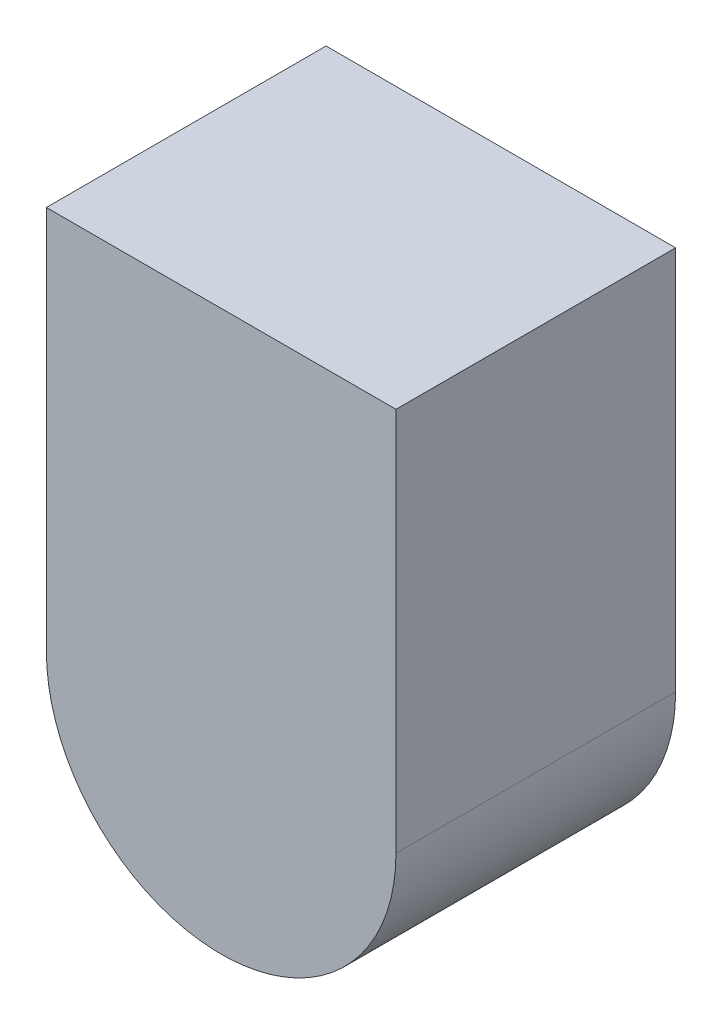
ISO-10303-21;
HEADER;
FILE_DESCRIPTION(('STEP AP214'),'2;1');
FILE_NAME('part.step','',(''),(''),'','','');
FILE_SCHEMA(('AUTOMOTIVE_DESIGN { 1 0 10303 214 1 1 1 1 }'));
ENDSEC;
DATA;
#1=APPLICATION_CONTEXT('core data for automotive mechanical design processes');
#2=APPLICATION_PROTOCOL_DEFINITION('international standard','automotive_design',2000,#1);
#3=PRODUCT_CONTEXT('',#1,'mechanical');
#4=PRODUCT('Part','Part','',(#3));
#5=PRODUCT_RELATED_PRODUCT_CATEGORY('part','',(#4));
#6=PRODUCT_DEFINITION_FORMATION('','',#4);
#7=PRODUCT_DEFINITION_CONTEXT('part definition',#1,'design');
#8=PRODUCT_DEFINITION('design','',#6,#7);
#9=PRODUCT_DEFINITION_SHAPE('','',#8);
#10=(LENGTH_UNIT() NAMED_UNIT(*) SI_UNIT(.MILLI.,.METRE.));
#11=(NAMED_UNIT(*) PLANE_ANGLE_UNIT() SI_UNIT($,.RADIAN.));
#12=(NAMED_UNIT(*) SI_UNIT($,.STERADIAN.) SOLID_ANGLE_UNIT());
#13=UNCERTAINTY_MEASURE_WITH_UNIT(LENGTH_MEASURE(1.E-05),#10,'distance_accuracy_value','');
#14=(GEOMETRIC_REPRESENTATION_CONTEXT(3) GLOBAL_UNCERTAINTY_ASSIGNED_CONTEXT((#13)) GLOBAL_UNIT_ASSIGNED_CONTEXT((#10,
#11,#12)) REPRESENTATION_CONTEXT('',''));
#15=CARTESIAN_POINT('',(0.,0.,0.));
#16=DIRECTION('',(0.,0.,1.));
#17=DIRECTION('',(1.,0.,0.));
#18=AXIS2_PLACEMENT_3D('',#15,#16,#17);
#19=CARTESIAN_POINT('',(-0.375000000000003,1.,0.));
#20=DIRECTION('',(0.,1.,0.));
#21=DIRECTION('',(-1.,0.,0.));
#22=AXIS2_PLACEMENT_3D('',#19,#20,#21);
#23=PLANE('',#22);
#24=DIRECTION('',(-1.,0.,0.));
#25=VECTOR('',#24,1.);
#26=CARTESIAN_POINT('',(-0.375000000000003,1.,0.));
#27=LINE('',#26,#25);
#28=CARTESIAN_POINT('',(-0.375000000000003,1.,0.));
#29=VERTEX_POINT('',#28);
#30=CARTESIAN_POINT('',(-0.625000000000002,1.,0.));
#31=VERTEX_POINT('',#30);
#32=EDGE_CURVE('E11',#29,#31,#27,.T.);
#33=ORIENTED_EDGE('',*,*,#32,.T.);
#34=DIRECTION('',(0.,0.,1.));
#35=VECTOR('',#34,1.);
#36=CARTESIAN_POINT('',(-0.625000000000002,1.,0.));
#37=LINE('',#36,#35);
#38=CARTESIAN_POINT('',(-0.625000000000002,1.,0.2));
#39=VERTEX_POINT('',#38);
#40=EDGE_CURVE('E24',#31,#39,#37,.T.);
#41=ORIENTED_EDGE('',*,*,#40,.T.);
#42=DIRECTION('',(-1.,0.,0.));
#43=VECTOR('',#42,1.);
#44=CARTESIAN_POINT('',(-0.375000000000003,1.,0.2));
#45=LINE('',#44,#43);
#46=CARTESIAN_POINT('',(-0.375000000000003,1.,0.2));
#47=VERTEX_POINT('',#46);
#48=EDGE_CURVE('E75',#47,#39,#45,.T.);
#49=ORIENTED_EDGE('',*,*,#48,.F.);
#50=DIRECTION('',(0.,0.,1.));
#51=VECTOR('',#50,1.);
#52=CARTESIAN_POINT('',(-0.375000000000003,1.,0.));
#53=LINE('',#52,#51);
#54=EDGE_CURVE('E86',#29,#47,#53,.T.);
#55=ORIENTED_EDGE('',*,*,#54,.F.);
#56=EDGE_LOOP('',(#33,#41,#49,#55));
#57=FACE_BOUND('',#56,.T.);
#58=ADVANCED_FACE('F17',(#57),#23,.T.);
#59=CARTESIAN_POINT('',(-0.375000000000003,0.725,0.));
#60=DIRECTION('',(1.,0.,0.));
#61=DIRECTION('',(0.,1.,0.));
#62=AXIS2_PLACEMENT_3D('',#59,#60,#61);
#63=PLANE('',#62);
#64=DIRECTION('',(0.,1.,0.));
#65=VECTOR('',#64,1.);
#66=CARTESIAN_POINT('',(-0.375000000000003,0.725,0.));
#67=LINE('',#66,#65);
#68=CARTESIAN_POINT('',(-0.375000000000003,0.725,0.));
#69=VERTEX_POINT('',#68);
#70=EDGE_CURVE('E83',#69,#29,#67,.T.);
#71=ORIENTED_EDGE('',*,*,#70,.T.);
#72=ORIENTED_EDGE('',*,*,#54,.T.);
#73=DIRECTION('',(0.,1.,0.));
#74=VECTOR('',#73,1.);
#75=CARTESIAN_POINT('',(-0.375000000000003,0.725,0.2));
#76=LINE('',#75,#74);
#77=CARTESIAN_POINT('',(-0.375000000000003,0.725,0.2));
#78=VERTEX_POINT('',#77);
#79=EDGE_CURVE('E81',#78,#47,#76,.T.);
#80=ORIENTED_EDGE('',*,*,#79,.F.);
#81=DIRECTION('',(0.,0.,1.));
#82=VECTOR('',#81,1.);
#83=CARTESIAN_POINT('',(-0.375000000000003,0.725,0.));
#84=LINE('',#83,#82);
#85=EDGE_CURVE('E61',#69,#78,#84,.T.);
#86=ORIENTED_EDGE('',*,*,#85,.F.);
#87=EDGE_LOOP('',(#71,#72,#80,#86));
#88=FACE_BOUND('',#87,.T.);
#89=ADVANCED_FACE('F91',(#88),#63,.T.);
#90=CARTESIAN_POINT('',(-0.500000000000003,0.724999999999999,0.));
#91=DIRECTION('',(0.,0.,1.));
#92=DIRECTION('',(-1.,0.,0.));
#93=AXIS2_PLACEMENT_3D('',#90,#91,#92);
#94=CYLINDRICAL_SURFACE('',#93,0.125);
#95=CARTESIAN_POINT('',(-0.500000000000003,0.724999999999999,0.));
#96=DIRECTION('',(0.,0.,1.));
#97=DIRECTION('',(-1.,0.,0.));
#98=AXIS2_PLACEMENT_3D('',#95,#96,#97);
#99=CIRCLE('',#98,0.125);
#100=CARTESIAN_POINT('',(-0.625000000000001,0.724999999999999,0.));
#101=VERTEX_POINT('',#100);
#102=EDGE_CURVE('E65',#101,#69,#99,.T.);
#103=ORIENTED_EDGE('',*,*,#102,.T.);
#104=ORIENTED_EDGE('',*,*,#85,.T.);
#105=CARTESIAN_POINT('',(-0.500000000000003,0.724999999999999,0.2));
#106=DIRECTION('',(0.,0.,1.));
#107=DIRECTION('',(-1.,0.,0.));
#108=AXIS2_PLACEMENT_3D('',#105,#106,#107);
#109=CIRCLE('',#108,0.125);
#110=CARTESIAN_POINT('',(-0.625000000000001,0.724999999999999,0.2));
#111=VERTEX_POINT('',#110);
#112=EDGE_CURVE('E54',#111,#78,#109,.T.);
#113=ORIENTED_EDGE('',*,*,#112,.F.);
#114=DIRECTION('',(0.,0.,1.));
#115=VECTOR('',#114,1.);
#116=CARTESIAN_POINT('',(-0.625000000000001,0.724999999999999,0.));
#117=LINE('',#116,#115);
#118=EDGE_CURVE('E58',#101,#111,#117,.T.);
#119=ORIENTED_EDGE('',*,*,#118,.F.);
#120=EDGE_LOOP('',(#103,#104,#113,#119));
#121=FACE_BOUND('',#120,.T.);
#122=ADVANCED_FACE('F57',(#121),#94,.T.);
#123=CARTESIAN_POINT('',(-0.625000000000002,1.,0.));
#124=DIRECTION('',(-1.,0.,0.));
#125=DIRECTION('',(0.,-1.,0.));
#126=AXIS2_PLACEMENT_3D('',#123,#124,#125);
#127=PLANE('',#126);
#128=DIRECTION('',(0.,-1.,0.));
#129=VECTOR('',#128,1.);
#130=CARTESIAN_POINT('',(-0.625000000000002,1.,0.));
#131=LINE('',#130,#129);
#132=EDGE_CURVE('E71',#31,#101,#131,.T.);
#133=ORIENTED_EDGE('',*,*,#132,.T.);
#134=ORIENTED_EDGE('',*,*,#118,.T.);
#135=DIRECTION('',(0.,-1.,0.));
#136=VECTOR('',#135,1.);
#137=CARTESIAN_POINT('',(-0.625000000000002,1.,0.2));
#138=LINE('',#137,#136);
#139=EDGE_CURVE('E70',#39,#111,#138,.T.);
#140=ORIENTED_EDGE('',*,*,#139,.F.);
#141=ORIENTED_EDGE('',*,*,#40,.F.);
#142=EDGE_LOOP('',(#133,#134,#140,#141));
#143=FACE_BOUND('',#142,.T.);
#144=ADVANCED_FACE('F69',(#143),#127,.T.);
#145=CARTESIAN_POINT('',(-0.500000000000003,0.8,0.2));
#146=DIRECTION('',(0.,0.,1.));
#147=DIRECTION('',(1.,0.,0.));
#148=AXIS2_PLACEMENT_3D('',#145,#146,#147);
#149=PLANE('',#148);
#150=ORIENTED_EDGE('',*,*,#139,.T.);
#151=ORIENTED_EDGE('',*,*,#112,.T.);
#152=ORIENTED_EDGE('',*,*,#79,.T.);
#153=ORIENTED_EDGE('',*,*,#48,.T.);
#154=EDGE_LOOP('',(#150,#151,#152,#153));
#155=FACE_BOUND('',#154,.T.);
#156=ADVANCED_FACE('F74',(#155),#149,.T.);
#157=CARTESIAN_POINT('',(-0.500000000000003,0.8,0.));
#158=DIRECTION('',(0.,0.,1.));
#159=DIRECTION('',(1.,0.,0.));
#160=AXIS2_PLACEMENT_3D('',#157,#158,#159);
#161=PLANE('',#160);
#162=ORIENTED_EDGE('',*,*,#132,.F.);
#163=ORIENTED_EDGE('',*,*,#32,.F.);
#164=ORIENTED_EDGE('',*,*,#70,.F.);
#165=ORIENTED_EDGE('',*,*,#102,.F.);
#166=EDGE_LOOP('',(#162,#163,#164,#165));
#167=FACE_BOUND('',#166,.T.);
#168=ADVANCED_FACE('F89',(#167),#161,.F.);
#169=CLOSED_SHELL('',(#58,#89,#122,#144,#156,#168));
#170=MANIFOLD_SOLID_BREP('B1',#169);
#171=ADVANCED_BREP_SHAPE_REPRESENTATION('',(#18,#170),#14);
#172=SHAPE_DEFINITION_REPRESENTATION(#9,#171);
ENDSEC;
END-ISO-10303-21;
